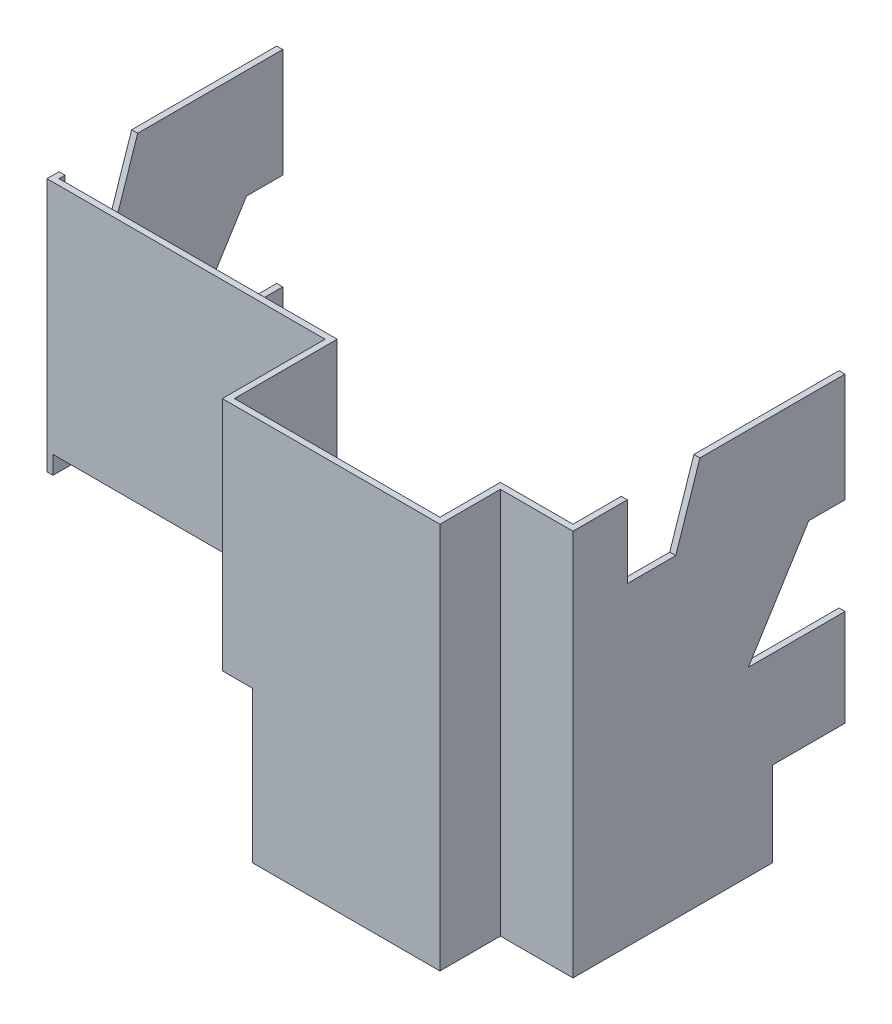
ISO-10303-21;
HEADER;
FILE_DESCRIPTION(('STEP AP214'),'2;1');
FILE_NAME('part.step','',(''),(''),'','','');
FILE_SCHEMA(('AUTOMOTIVE_DESIGN { 1 0 10303 214 1 1 1 1 }'));
ENDSEC;
DATA;
#1=APPLICATION_CONTEXT('core data for automotive mechanical design processes');
#2=APPLICATION_PROTOCOL_DEFINITION('international standard','automotive_design',2000,#1);
#3=PRODUCT_CONTEXT('',#1,'mechanical');
#4=PRODUCT('Part','Part','',(#3));
#5=PRODUCT_RELATED_PRODUCT_CATEGORY('part','',(#4));
#6=PRODUCT_DEFINITION_FORMATION('','',#4);
#7=PRODUCT_DEFINITION_CONTEXT('part definition',#1,'design');
#8=PRODUCT_DEFINITION('design','',#6,#7);
#9=PRODUCT_DEFINITION_SHAPE('','',#8);
#10=(LENGTH_UNIT() NAMED_UNIT(*) SI_UNIT(.MILLI.,.METRE.));
#11=(NAMED_UNIT(*) PLANE_ANGLE_UNIT() SI_UNIT($,.RADIAN.));
#12=(NAMED_UNIT(*) SI_UNIT($,.STERADIAN.) SOLID_ANGLE_UNIT());
#13=UNCERTAINTY_MEASURE_WITH_UNIT(LENGTH_MEASURE(1.E-05),#10,'distance_accuracy_value','');
#14=(GEOMETRIC_REPRESENTATION_CONTEXT(3) GLOBAL_UNCERTAINTY_ASSIGNED_CONTEXT((#13)) GLOBAL_UNIT_ASSIGNED_CONTEXT((#10,
#11,#12)) REPRESENTATION_CONTEXT('',''));
#15=CARTESIAN_POINT('',(0.,0.,0.));
#16=DIRECTION('',(0.,0.,1.));
#17=DIRECTION('',(1.,0.,0.));
#18=AXIS2_PLACEMENT_3D('',#15,#16,#17);
#19=CARTESIAN_POINT('',(596.9,406.4,-241.3));
#20=DIRECTION('',(0.,0.,1.));
#21=DIRECTION('',(1.,0.,0.));
#22=AXIS2_PLACEMENT_3D('',#19,#20,#21);
#23=PLANE('',#22);
#24=DIRECTION('',(0.,-1.,0.));
#25=VECTOR('',#24,1.);
#26=CARTESIAN_POINT('',(596.9,406.4,-241.3));
#27=LINE('',#26,#25);
#28=CARTESIAN_POINT('',(596.9,406.4,-241.3));
#29=VERTEX_POINT('',#28);
#30=CARTESIAN_POINT('',(596.9,292.1,-241.3));
#31=VERTEX_POINT('',#30);
#32=EDGE_CURVE('E314',#29,#31,#27,.T.);
#33=ORIENTED_EDGE('',*,*,#32,.T.);
#34=DIRECTION('',(-1.,0.,0.));
#35=VECTOR('',#34,1.);
#36=CARTESIAN_POINT('',(596.9,292.1,-241.3));
#37=LINE('',#36,#35);
#38=CARTESIAN_POINT('',(590.55,292.1,-241.3));
#39=VERTEX_POINT('',#38);
#40=EDGE_CURVE('E564',#31,#39,#37,.T.);
#41=ORIENTED_EDGE('',*,*,#40,.T.);
#42=DIRECTION('',(0.,-1.,0.));
#43=VECTOR('',#42,1.);
#44=CARTESIAN_POINT('',(590.55,406.4,-241.3));
#45=LINE('',#44,#43);
#46=CARTESIAN_POINT('',(590.55,406.4,-241.3));
#47=VERTEX_POINT('',#46);
#48=EDGE_CURVE('E315',#47,#39,#45,.T.);
#49=ORIENTED_EDGE('',*,*,#48,.F.);
#50=DIRECTION('',(-1.,0.,0.));
#51=VECTOR('',#50,1.);
#52=CARTESIAN_POINT('',(596.9,406.4,-241.3));
#53=LINE('',#52,#51);
#54=EDGE_CURVE('E503',#29,#47,#53,.T.);
#55=ORIENTED_EDGE('',*,*,#54,.F.);
#56=EDGE_LOOP('',(#33,#41,#49,#55));
#57=FACE_BOUND('',#56,.T.);
#58=ADVANCED_FACE('F39',(#57),#23,.F.);
#59=CARTESIAN_POINT('',(0.,406.4,-241.3));
#60=DIRECTION('',(0.,0.,1.));
#61=DIRECTION('',(1.,0.,0.));
#62=AXIS2_PLACEMENT_3D('',#59,#60,#61);
#63=PLANE('',#62);
#64=DIRECTION('',(0.,-1.,0.));
#65=VECTOR('',#64,1.);
#66=CARTESIAN_POINT('',(6.35,406.4,-241.3));
#67=LINE('',#66,#65);
#68=CARTESIAN_POINT('',(6.35,406.4,-241.3));
#69=VERTEX_POINT('',#68);
#70=CARTESIAN_POINT('',(6.34999999999997,292.1,-241.3));
#71=VERTEX_POINT('',#70);
#72=EDGE_CURVE('E393',#69,#71,#67,.T.);
#73=ORIENTED_EDGE('',*,*,#72,.T.);
#74=CARTESIAN_POINT('',(0.,292.1,-241.3));
#75=VERTEX_POINT('',#74);
#76=EDGE_CURVE('E535',#71,#75,#37,.T.);
#77=ORIENTED_EDGE('',*,*,#76,.T.);
#78=DIRECTION('',(0.,-1.,0.));
#79=VECTOR('',#78,1.);
#80=CARTESIAN_POINT('',(0.,406.4,-241.3));
#81=LINE('',#80,#79);
#82=CARTESIAN_POINT('',(0.,406.4,-241.3));
#83=VERTEX_POINT('',#82);
#84=EDGE_CURVE('E390',#83,#75,#81,.T.);
#85=ORIENTED_EDGE('',*,*,#84,.F.);
#86=DIRECTION('',(-1.,0.,0.));
#87=VECTOR('',#86,1.);
#88=CARTESIAN_POINT('',(0.,406.4,-241.3));
#89=LINE('',#88,#87);
#90=EDGE_CURVE('E362',#69,#83,#89,.T.);
#91=ORIENTED_EDGE('',*,*,#90,.F.);
#92=EDGE_LOOP('',(#73,#77,#85,#91));
#93=FACE_BOUND('',#92,.T.);
#94=ADVANCED_FACE('F533',(#93),#63,.F.);
#95=CARTESIAN_POINT('',(0.,406.4,0.));
#96=DIRECTION('',(0.,-1.,0.));
#97=DIRECTION('',(0.,0.,-1.));
#98=AXIS2_PLACEMENT_3D('',#95,#96,#97);
#99=PLANE('',#98);
#100=DIRECTION('',(0.,0.,1.));
#101=VECTOR('',#100,1.);
#102=CARTESIAN_POINT('',(590.55,406.4,-241.3));
#103=LINE('',#102,#101);
#104=CARTESIAN_POINT('',(590.55,406.4,-88.9));
#105=VERTEX_POINT('',#104);
#106=EDGE_CURVE('E506',#47,#105,#103,.T.);
#107=ORIENTED_EDGE('',*,*,#106,.T.);
#108=DIRECTION('',(-1.,0.,0.));
#109=VECTOR('',#108,1.);
#110=CARTESIAN_POINT('',(596.9,406.4,-88.9));
#111=LINE('',#110,#109);
#112=CARTESIAN_POINT('',(596.9,406.4,-88.9));
#113=VERTEX_POINT('',#112);
#114=EDGE_CURVE('E993',#113,#105,#111,.T.);
#115=ORIENTED_EDGE('',*,*,#114,.F.);
#116=DIRECTION('',(0.,0.,-1.));
#117=VECTOR('',#116,1.);
#118=CARTESIAN_POINT('',(596.9,406.4,44.45));
#119=LINE('',#118,#117);
#120=EDGE_CURVE('E500',#113,#29,#119,.T.);
#121=ORIENTED_EDGE('',*,*,#120,.T.);
#122=ORIENTED_EDGE('',*,*,#54,.T.);
#123=EDGE_LOOP('',(#107,#115,#121,#122));
#124=FACE_BOUND('',#123,.T.);
#125=ADVANCED_FACE('F656',(#124),#99,.F.);
#126=DIRECTION('',(0.,0.,1.));
#127=VECTOR('',#126,1.);
#128=CARTESIAN_POINT('',(0.,406.4,0.));
#129=LINE('',#128,#127);
#130=CARTESIAN_POINT('',(0.,406.4,-88.9));
#131=VERTEX_POINT('',#130);
#132=EDGE_CURVE('E361',#83,#131,#129,.T.);
#133=ORIENTED_EDGE('',*,*,#132,.T.);
#134=DIRECTION('',(1.,0.,0.));
#135=VECTOR('',#134,1.);
#136=CARTESIAN_POINT('',(0.,406.4,-88.9));
#137=LINE('',#136,#135);
#138=CARTESIAN_POINT('',(6.34999999999997,406.4,-88.9));
#139=VERTEX_POINT('',#138);
#140=EDGE_CURVE('E11',#131,#139,#137,.T.);
#141=ORIENTED_EDGE('',*,*,#140,.T.);
#142=DIRECTION('',(0.,0.,-1.));
#143=VECTOR('',#142,1.);
#144=CARTESIAN_POINT('',(6.35,406.4,-241.3));
#145=LINE('',#144,#143);
#146=EDGE_CURVE('E518',#139,#69,#145,.T.);
#147=ORIENTED_EDGE('',*,*,#146,.T.);
#148=ORIENTED_EDGE('',*,*,#90,.T.);
#149=EDGE_LOOP('',(#133,#141,#147,#148));
#150=FACE_BOUND('',#149,.T.);
#151=ADVANCED_FACE('F522',(#150),#99,.F.);
#152=CARTESIAN_POINT('',(0.,406.4,0.));
#153=DIRECTION('',(0.,0.,-1.));
#154=DIRECTION('',(-1.,0.,0.));
#155=AXIS2_PLACEMENT_3D('',#152,#153,#154);
#156=PLANE('',#155);
#157=DIRECTION('',(0.,-1.,0.));
#158=VECTOR('',#157,1.);
#159=CARTESIAN_POINT('',(0.,406.4,0.));
#160=LINE('',#159,#158);
#161=CARTESIAN_POINT('',(0.,406.4,0.));
#162=VERTEX_POINT('',#161);
#163=CARTESIAN_POINT('',(0.,139.7,0.));
#164=VERTEX_POINT('',#163);
#165=EDGE_CURVE('E359',#162,#164,#160,.T.);
#166=ORIENTED_EDGE('',*,*,#165,.T.);
#167=DIRECTION('',(-1.,0.,0.));
#168=VECTOR('',#167,1.);
#169=CARTESIAN_POINT('',(596.901,139.7,0.));
#170=LINE('',#169,#168);
#171=CARTESIAN_POINT('',(6.35000000000002,139.7,0.));
#172=VERTEX_POINT('',#171);
#173=EDGE_CURVE('E457',#172,#164,#170,.T.);
#174=ORIENTED_EDGE('',*,*,#173,.F.);
#175=DIRECTION('',(0.,1.,0.));
#176=VECTOR('',#175,1.);
#177=CARTESIAN_POINT('',(6.35,406.4,0.));
#178=LINE('',#177,#176);
#179=CARTESIAN_POINT('',(6.35000000000002,158.75,-1.11022302462516E-13));
#180=VERTEX_POINT('',#179);
#181=EDGE_CURVE('E478',#172,#180,#178,.T.);
#182=ORIENTED_EDGE('',*,*,#181,.T.);
#183=DIRECTION('',(1.,0.,0.));
#184=VECTOR('',#183,1.);
#185=CARTESIAN_POINT('',(0.,158.75,0.));
#186=LINE('',#185,#184);
#187=CARTESIAN_POINT('',(292.1,158.75,0.));
#188=VERTEX_POINT('',#187);
#189=EDGE_CURVE('E371',#180,#188,#186,.T.);
#190=ORIENTED_EDGE('',*,*,#189,.T.);
#191=DIRECTION('',(0.,-1.,0.));
#192=VECTOR('',#191,1.);
#193=CARTESIAN_POINT('',(292.1,406.4,0.));
#194=LINE('',#193,#192);
#195=CARTESIAN_POINT('',(292.1,406.4,0.));
#196=VERTEX_POINT('',#195);
#197=EDGE_CURVE('E334',#196,#188,#194,.T.);
#198=ORIENTED_EDGE('',*,*,#197,.F.);
#199=DIRECTION('',(1.,0.,0.));
#200=VECTOR('',#199,1.);
#201=CARTESIAN_POINT('',(0.,406.4,0.));
#202=LINE('',#201,#200);
#203=EDGE_CURVE('E387',#162,#196,#202,.T.);
#204=ORIENTED_EDGE('',*,*,#203,.F.);
#205=EDGE_LOOP('',(#166,#174,#182,#190,#198,#204));
#206=FACE_BOUND('',#205,.T.);
#207=ADVANCED_FACE('F41',(#206),#156,.F.);
#208=CARTESIAN_POINT('',(292.1,406.4,0.));
#209=DIRECTION('',(1.,0.,0.));
#210=DIRECTION('',(0.,0.,-1.));
#211=AXIS2_PLACEMENT_3D('',#208,#209,#210);
#212=PLANE('',#211);
#213=ORIENTED_EDGE('',*,*,#197,.T.);
#214=DIRECTION('',(0.,0.,1.));
#215=VECTOR('',#214,1.);
#216=CARTESIAN_POINT('',(292.1,158.75,0.));
#217=LINE('',#216,#215);
#218=CARTESIAN_POINT('',(292.1,158.75,107.95));
#219=VERTEX_POINT('',#218);
#220=EDGE_CURVE('E486',#188,#219,#217,.T.);
#221=ORIENTED_EDGE('',*,*,#220,.T.);
#222=DIRECTION('',(0.,-1.,0.));
#223=VECTOR('',#222,1.);
#224=CARTESIAN_POINT('',(292.1,406.4,107.95));
#225=LINE('',#224,#223);
#226=CARTESIAN_POINT('',(292.1,406.4,107.95));
#227=VERTEX_POINT('',#226);
#228=EDGE_CURVE('E331',#227,#219,#225,.T.);
#229=ORIENTED_EDGE('',*,*,#228,.F.);
#230=DIRECTION('',(0.,0.,1.));
#231=VECTOR('',#230,1.);
#232=CARTESIAN_POINT('',(292.1,406.4,0.));
#233=LINE('',#232,#231);
#234=EDGE_CURVE('E492',#196,#227,#233,.T.);
#235=ORIENTED_EDGE('',*,*,#234,.F.);
#236=EDGE_LOOP('',(#213,#221,#229,#235));
#237=FACE_BOUND('',#236,.T.);
#238=ADVANCED_FACE('F675',(#237),#212,.F.);
#239=CARTESIAN_POINT('',(292.1,406.4,107.95));
#240=DIRECTION('',(0.,0.,-1.));
#241=DIRECTION('',(-1.,0.,0.));
#242=AXIS2_PLACEMENT_3D('',#239,#240,#241);
#243=PLANE('',#242);
#244=ORIENTED_EDGE('',*,*,#228,.T.);
#245=DIRECTION('',(-1.,0.,0.));
#246=VECTOR('',#245,1.);
#247=CARTESIAN_POINT('',(323.85,158.75,107.95));
#248=LINE('',#247,#246);
#249=CARTESIAN_POINT('',(323.85,158.75,107.95));
#250=VERTEX_POINT('',#249);
#251=EDGE_CURVE('E470',#250,#219,#248,.T.);
#252=ORIENTED_EDGE('',*,*,#251,.F.);
#253=DIRECTION('',(0.,1.,0.));
#254=VECTOR('',#253,1.);
#255=CARTESIAN_POINT('',(323.85,0.,107.95));
#256=LINE('',#255,#254);
#257=CARTESIAN_POINT('',(323.85,0.,107.95));
#258=VERTEX_POINT('',#257);
#259=EDGE_CURVE('E463',#258,#250,#256,.T.);
#260=ORIENTED_EDGE('',*,*,#259,.F.);
#261=DIRECTION('',(1.,0.,0.));
#262=VECTOR('',#261,1.);
#263=CARTESIAN_POINT('',(292.1,0.,107.95));
#264=LINE('',#263,#262);
#265=CARTESIAN_POINT('',(520.7,0.,107.95));
#266=VERTEX_POINT('',#265);
#267=EDGE_CURVE('E368',#258,#266,#264,.T.);
#268=ORIENTED_EDGE('',*,*,#267,.T.);
#269=DIRECTION('',(0.,-1.,0.));
#270=VECTOR('',#269,1.);
#271=CARTESIAN_POINT('',(520.7,406.4,107.95));
#272=LINE('',#271,#270);
#273=CARTESIAN_POINT('',(520.7,406.4,107.95));
#274=VERTEX_POINT('',#273);
#275=EDGE_CURVE('E328',#274,#266,#272,.T.);
#276=ORIENTED_EDGE('',*,*,#275,.F.);
#277=DIRECTION('',(1.,0.,0.));
#278=VECTOR('',#277,1.);
#279=CARTESIAN_POINT('',(292.1,406.4,107.95));
#280=LINE('',#279,#278);
#281=EDGE_CURVE('E494',#227,#274,#280,.T.);
#282=ORIENTED_EDGE('',*,*,#281,.F.);
#283=EDGE_LOOP('',(#244,#252,#260,#268,#276,#282));
#284=FACE_BOUND('',#283,.T.);
#285=ADVANCED_FACE('F614',(#284),#243,.F.);
#286=CARTESIAN_POINT('',(520.7,406.4,107.95));
#287=DIRECTION('',(-1.,0.,0.));
#288=DIRECTION('',(0.,0.,1.));
#289=AXIS2_PLACEMENT_3D('',#286,#287,#288);
#290=PLANE('',#289);
#291=DIRECTION('',(0.,0.,-1.));
#292=VECTOR('',#291,1.);
#293=CARTESIAN_POINT('',(520.7,0.,107.95));
#294=LINE('',#293,#292);
#295=CARTESIAN_POINT('',(520.7,0.,44.45));
#296=VERTEX_POINT('',#295);
#297=EDGE_CURVE('E370',#266,#296,#294,.T.);
#298=ORIENTED_EDGE('',*,*,#297,.T.);
#299=DIRECTION('',(0.,-1.,0.));
#300=VECTOR('',#299,1.);
#301=CARTESIAN_POINT('',(520.7,406.4,44.45));
#302=LINE('',#301,#300);
#303=CARTESIAN_POINT('',(520.7,406.4,44.45));
#304=VERTEX_POINT('',#303);
#305=EDGE_CURVE('E325',#304,#296,#302,.T.);
#306=ORIENTED_EDGE('',*,*,#305,.F.);
#307=DIRECTION('',(0.,0.,-1.));
#308=VECTOR('',#307,1.);
#309=CARTESIAN_POINT('',(520.7,406.4,107.95));
#310=LINE('',#309,#308);
#311=EDGE_CURVE('E496',#274,#304,#310,.T.);
#312=ORIENTED_EDGE('',*,*,#311,.F.);
#313=ORIENTED_EDGE('',*,*,#275,.T.);
#314=EDGE_LOOP('',(#298,#306,#312,#313));
#315=FACE_BOUND('',#314,.T.);
#316=ADVANCED_FACE('F609',(#315),#290,.F.);
#317=CARTESIAN_POINT('',(520.7,406.4,44.45));
#318=DIRECTION('',(0.,0.,-1.));
#319=DIRECTION('',(-1.,0.,0.));
#320=AXIS2_PLACEMENT_3D('',#317,#318,#319);
#321=PLANE('',#320);
#322=DIRECTION('',(1.,0.,0.));
#323=VECTOR('',#322,1.);
#324=CARTESIAN_POINT('',(520.7,0.,44.45));
#325=LINE('',#324,#323);
#326=CARTESIAN_POINT('',(596.9,0.,44.45));
#327=VERTEX_POINT('',#326);
#328=EDGE_CURVE('E373',#296,#327,#325,.T.);
#329=ORIENTED_EDGE('',*,*,#328,.T.);
#330=DIRECTION('',(0.,-1.,0.));
#331=VECTOR('',#330,1.);
#332=CARTESIAN_POINT('',(596.9,406.4,44.45));
#333=LINE('',#332,#331);
#334=CARTESIAN_POINT('',(596.9,406.4,44.45));
#335=VERTEX_POINT('',#334);
#336=EDGE_CURVE('E318',#335,#327,#333,.T.);
#337=ORIENTED_EDGE('',*,*,#336,.F.);
#338=DIRECTION('',(1.,0.,0.));
#339=VECTOR('',#338,1.);
#340=CARTESIAN_POINT('',(520.7,406.4,44.45));
#341=LINE('',#340,#339);
#342=EDGE_CURVE('E498',#304,#335,#341,.T.);
#343=ORIENTED_EDGE('',*,*,#342,.F.);
#344=ORIENTED_EDGE('',*,*,#305,.T.);
#345=EDGE_LOOP('',(#329,#337,#343,#344));
#346=FACE_BOUND('',#345,.T.);
#347=ADVANCED_FACE('F603',(#346),#321,.F.);
#348=CARTESIAN_POINT('',(596.9,406.4,44.45));
#349=DIRECTION('',(-1.,0.,0.));
#350=DIRECTION('',(0.,0.,1.));
#351=AXIS2_PLACEMENT_3D('',#348,#349,#350);
#352=PLANE('',#351);
#353=DIRECTION('',(0.,0.847998304005088,-0.52999894000318));
#354=VECTOR('',#353,1.);
#355=CARTESIAN_POINT('',(596.9,292.1,-203.2));
#356=LINE('',#355,#354);
#357=CARTESIAN_POINT('',(596.9,190.5,-139.7));
#358=VERTEX_POINT('',#357);
#359=CARTESIAN_POINT('',(596.9,292.1,-203.2));
#360=VERTEX_POINT('',#359);
#361=EDGE_CURVE('E297',#358,#360,#356,.T.);
#362=ORIENTED_EDGE('',*,*,#361,.T.);
#363=DIRECTION('',(0.,0.,-1.));
#364=VECTOR('',#363,1.);
#365=CARTESIAN_POINT('',(596.9,292.1,-241.3));
#366=LINE('',#365,#364);
#367=EDGE_CURVE('E974',#360,#31,#366,.T.);
#368=ORIENTED_EDGE('',*,*,#367,.T.);
#369=ORIENTED_EDGE('',*,*,#32,.F.);
#370=ORIENTED_EDGE('',*,*,#120,.F.);
#371=DIRECTION('',(0.,-0.948683298050514,0.316227766016838));
#372=VECTOR('',#371,1.);
#373=CARTESIAN_POINT('',(596.9,406.4,-88.9));
#374=LINE('',#373,#372);
#375=CARTESIAN_POINT('',(596.9,330.2,-63.5));
#376=VERTEX_POINT('',#375);
#377=EDGE_CURVE('E558',#113,#376,#374,.T.);
#378=ORIENTED_EDGE('',*,*,#377,.T.);
#379=DIRECTION('',(0.,0.,1.));
#380=VECTOR('',#379,1.);
#381=CARTESIAN_POINT('',(596.9,330.2,-63.5));
#382=LINE('',#381,#380);
#383=CARTESIAN_POINT('',(596.9,330.2,-12.7));
#384=VERTEX_POINT('',#383);
#385=EDGE_CURVE('E554',#376,#384,#382,.T.);
#386=ORIENTED_EDGE('',*,*,#385,.T.);
#387=DIRECTION('',(0.,1.,0.));
#388=VECTOR('',#387,1.);
#389=CARTESIAN_POINT('',(596.9,406.4,-12.7));
#390=LINE('',#389,#388);
#391=CARTESIAN_POINT('',(596.9,406.4,-12.7));
#392=VERTEX_POINT('',#391);
#393=EDGE_CURVE('E551',#384,#392,#390,.T.);
#394=ORIENTED_EDGE('',*,*,#393,.T.);
#395=EDGE_CURVE('E501',#335,#392,#119,.T.);
#396=ORIENTED_EDGE('',*,*,#395,.F.);
#397=ORIENTED_EDGE('',*,*,#336,.T.);
#398=DIRECTION('',(0.,0.,-1.));
#399=VECTOR('',#398,1.);
#400=CARTESIAN_POINT('',(596.9,0.,44.45));
#401=LINE('',#400,#399);
#402=CARTESIAN_POINT('',(596.9,0.,-165.1));
#403=VERTEX_POINT('',#402);
#404=EDGE_CURVE('E375',#327,#403,#401,.T.);
#405=ORIENTED_EDGE('',*,*,#404,.T.);
#406=DIRECTION('',(0.,-1.,0.));
#407=VECTOR('',#406,1.);
#408=CARTESIAN_POINT('',(596.9,0.,-165.1));
#409=LINE('',#408,#407);
#410=CARTESIAN_POINT('',(596.9,88.9,-165.1));
#411=VERTEX_POINT('',#410);
#412=EDGE_CURVE('E432',#411,#403,#409,.T.);
#413=ORIENTED_EDGE('',*,*,#412,.F.);
#414=DIRECTION('',(0.,0.,1.));
#415=VECTOR('',#414,1.);
#416=CARTESIAN_POINT('',(596.9,88.9,-241.3));
#417=LINE('',#416,#415);
#418=CARTESIAN_POINT('',(596.9,88.9,-241.3));
#419=VERTEX_POINT('',#418);
#420=EDGE_CURVE('E313',#419,#411,#417,.T.);
#421=ORIENTED_EDGE('',*,*,#420,.F.);
#422=CARTESIAN_POINT('',(596.9,190.5,-241.3));
#423=VERTEX_POINT('',#422);
#424=EDGE_CURVE('E304',#423,#419,#27,.T.);
#425=ORIENTED_EDGE('',*,*,#424,.F.);
#426=DIRECTION('',(0.,0.,1.));
#427=VECTOR('',#426,1.);
#428=CARTESIAN_POINT('',(596.9,190.5,-241.3));
#429=LINE('',#428,#427);
#430=EDGE_CURVE('E289',#423,#358,#429,.T.);
#431=ORIENTED_EDGE('',*,*,#430,.T.);
#432=EDGE_LOOP('',(#362,#368,#369,#370,#378,#386,#394,#396,#397,#405,#413,#421,#425,#431));
#433=FACE_BOUND('',#432,.T.);
#434=ADVANCED_FACE('F310',(#433),#352,.F.);
#435=CARTESIAN_POINT('',(590.55,190.5,-241.3));
#436=VERTEX_POINT('',#435);
#437=CARTESIAN_POINT('',(590.55,88.9,-241.3));
#438=VERTEX_POINT('',#437);
#439=EDGE_CURVE('E306',#436,#438,#45,.T.);
#440=ORIENTED_EDGE('',*,*,#439,.F.);
#441=DIRECTION('',(-1.,0.,0.));
#442=VECTOR('',#441,1.);
#443=CARTESIAN_POINT('',(596.9,190.5,-241.3));
#444=LINE('',#443,#442);
#445=EDGE_CURVE('E54',#423,#436,#444,.T.);
#446=ORIENTED_EDGE('',*,*,#445,.F.);
#447=ORIENTED_EDGE('',*,*,#424,.T.);
#448=DIRECTION('',(1.,0.,0.));
#449=VECTOR('',#448,1.);
#450=CARTESIAN_POINT('',(-0.00100000000013978,88.9,-241.3));
#451=LINE('',#450,#449);
#452=EDGE_CURVE('E426',#438,#419,#451,.T.);
#453=ORIENTED_EDGE('',*,*,#452,.F.);
#454=EDGE_LOOP('',(#440,#446,#447,#453));
#455=FACE_BOUND('',#454,.T.);
#456=ADVANCED_FACE('F302',(#455),#23,.F.);
#457=CARTESIAN_POINT('',(590.55,406.4,-241.3));
#458=DIRECTION('',(1.,0.,0.));
#459=DIRECTION('',(0.,0.,-1.));
#460=AXIS2_PLACEMENT_3D('',#457,#458,#459);
#461=PLANE('',#460);
#462=ORIENTED_EDGE('',*,*,#48,.T.);
#463=DIRECTION('',(0.,0.,1.));
#464=VECTOR('',#463,1.);
#465=CARTESIAN_POINT('',(590.55,292.1,-241.3));
#466=LINE('',#465,#464);
#467=CARTESIAN_POINT('',(590.55,292.1,-203.2));
#468=VERTEX_POINT('',#467);
#469=EDGE_CURVE('E587',#39,#468,#466,.T.);
#470=ORIENTED_EDGE('',*,*,#469,.T.);
#471=DIRECTION('',(0.,-0.847998304005088,0.52999894000318));
#472=VECTOR('',#471,1.);
#473=CARTESIAN_POINT('',(590.55,391.416853932584,-265.273033707865));
#474=LINE('',#473,#472);
#475=CARTESIAN_POINT('',(590.55,190.5,-139.7));
#476=VERTEX_POINT('',#475);
#477=EDGE_CURVE('E584',#468,#476,#474,.T.);
#478=ORIENTED_EDGE('',*,*,#477,.T.);
#479=DIRECTION('',(0.,0.,-1.));
#480=VECTOR('',#479,1.);
#481=CARTESIAN_POINT('',(590.55,190.5,-241.3));
#482=LINE('',#481,#480);
#483=EDGE_CURVE('E423',#476,#436,#482,.T.);
#484=ORIENTED_EDGE('',*,*,#483,.T.);
#485=ORIENTED_EDGE('',*,*,#439,.T.);
#486=DIRECTION('',(0.,0.,-1.));
#487=VECTOR('',#486,1.);
#488=CARTESIAN_POINT('',(590.55,88.9,-241.3));
#489=LINE('',#488,#487);
#490=CARTESIAN_POINT('',(590.55,88.9,-165.1));
#491=VERTEX_POINT('',#490);
#492=EDGE_CURVE('E421',#491,#438,#489,.T.);
#493=ORIENTED_EDGE('',*,*,#492,.F.);
#494=DIRECTION('',(0.,1.,0.));
#495=VECTOR('',#494,1.);
#496=CARTESIAN_POINT('',(590.55,0.,-165.1));
#497=LINE('',#496,#495);
#498=CARTESIAN_POINT('',(590.55,0.,-165.1));
#499=VERTEX_POINT('',#498);
#500=EDGE_CURVE('E590',#499,#491,#497,.T.);
#501=ORIENTED_EDGE('',*,*,#500,.F.);
#502=DIRECTION('',(0.,0.,1.));
#503=VECTOR('',#502,1.);
#504=CARTESIAN_POINT('',(590.55,0.,-241.3));
#505=LINE('',#504,#503);
#506=CARTESIAN_POINT('',(590.55,0.,38.1));
#507=VERTEX_POINT('',#506);
#508=EDGE_CURVE('E378',#499,#507,#505,.T.);
#509=ORIENTED_EDGE('',*,*,#508,.T.);
#510=DIRECTION('',(0.,-1.,0.));
#511=VECTOR('',#510,1.);
#512=CARTESIAN_POINT('',(590.55,406.4,38.1));
#513=LINE('',#512,#511);
#514=CARTESIAN_POINT('',(590.55,406.4,38.1));
#515=VERTEX_POINT('',#514);
#516=EDGE_CURVE('E410',#515,#507,#513,.T.);
#517=ORIENTED_EDGE('',*,*,#516,.F.);
#518=CARTESIAN_POINT('',(590.55,406.4,-12.7));
#519=VERTEX_POINT('',#518);
#520=EDGE_CURVE('E505',#519,#515,#103,.T.);
#521=ORIENTED_EDGE('',*,*,#520,.F.);
#522=DIRECTION('',(0.,-1.,0.));
#523=VECTOR('',#522,1.);
#524=CARTESIAN_POINT('',(590.55,406.4,-12.7));
#525=LINE('',#524,#523);
#526=CARTESIAN_POINT('',(590.55,330.2,-12.7));
#527=VERTEX_POINT('',#526);
#528=EDGE_CURVE('E563',#519,#527,#525,.T.);
#529=ORIENTED_EDGE('',*,*,#528,.T.);
#530=DIRECTION('',(0.,0.,-1.));
#531=VECTOR('',#530,1.);
#532=CARTESIAN_POINT('',(590.55,330.2,-241.3));
#533=LINE('',#532,#531);
#534=CARTESIAN_POINT('',(590.55,330.2,-63.5));
#535=VERTEX_POINT('',#534);
#536=EDGE_CURVE('E575',#527,#535,#533,.T.);
#537=ORIENTED_EDGE('',*,*,#536,.T.);
#538=DIRECTION('',(0.,0.948683298050514,-0.316227766016838));
#539=VECTOR('',#538,1.);
#540=CARTESIAN_POINT('',(590.55,452.12,-104.14));
#541=LINE('',#540,#539);
#542=EDGE_CURVE('E569',#535,#105,#541,.T.);
#543=ORIENTED_EDGE('',*,*,#542,.T.);
#544=ORIENTED_EDGE('',*,*,#106,.F.);
#545=EDGE_LOOP('',(#462,#470,#478,#484,#485,#493,#501,#509,#517,#521,#529,#537,#543,#544));
#546=FACE_BOUND('',#545,.T.);
#547=ADVANCED_FACE('F419',(#546),#461,.F.);
#548=CARTESIAN_POINT('',(590.55,406.4,38.1));
#549=DIRECTION('',(0.,0.,1.));
#550=DIRECTION('',(1.,0.,0.));
#551=AXIS2_PLACEMENT_3D('',#548,#549,#550);
#552=PLANE('',#551);
#553=DIRECTION('',(-1.,0.,0.));
#554=VECTOR('',#553,1.);
#555=CARTESIAN_POINT('',(590.55,0.,38.1));
#556=LINE('',#555,#554);
#557=CARTESIAN_POINT('',(514.35,0.,38.1));
#558=VERTEX_POINT('',#557);
#559=EDGE_CURVE('E380',#507,#558,#556,.T.);
#560=ORIENTED_EDGE('',*,*,#559,.T.);
#561=DIRECTION('',(0.,-1.,0.));
#562=VECTOR('',#561,1.);
#563=CARTESIAN_POINT('',(514.35,406.4,38.1));
#564=LINE('',#563,#562);
#565=CARTESIAN_POINT('',(514.35,406.4,38.1));
#566=VERTEX_POINT('',#565);
#567=EDGE_CURVE('E408',#566,#558,#564,.T.);
#568=ORIENTED_EDGE('',*,*,#567,.F.);
#569=DIRECTION('',(-1.,0.,0.));
#570=VECTOR('',#569,1.);
#571=CARTESIAN_POINT('',(590.55,406.4,38.1));
#572=LINE('',#571,#570);
#573=EDGE_CURVE('E509',#515,#566,#572,.T.);
#574=ORIENTED_EDGE('',*,*,#573,.F.);
#575=ORIENTED_EDGE('',*,*,#516,.T.);
#576=EDGE_LOOP('',(#560,#568,#574,#575));
#577=FACE_BOUND('',#576,.T.);
#578=ADVANCED_FACE('F631',(#577),#552,.F.);
#579=CARTESIAN_POINT('',(514.35,406.4,38.1));
#580=DIRECTION('',(1.,0.,0.));
#581=DIRECTION('',(0.,0.,-1.));
#582=AXIS2_PLACEMENT_3D('',#579,#580,#581);
#583=PLANE('',#582);
#584=DIRECTION('',(0.,0.,1.));
#585=VECTOR('',#584,1.);
#586=CARTESIAN_POINT('',(514.35,0.,38.1));
#587=LINE('',#586,#585);
#588=CARTESIAN_POINT('',(514.35,0.,101.6));
#589=VERTEX_POINT('',#588);
#590=EDGE_CURVE('E382',#558,#589,#587,.T.);
#591=ORIENTED_EDGE('',*,*,#590,.T.);
#592=DIRECTION('',(0.,-1.,0.));
#593=VECTOR('',#592,1.);
#594=CARTESIAN_POINT('',(514.35,406.4,101.6));
#595=LINE('',#594,#593);
#596=CARTESIAN_POINT('',(514.35,406.4,101.6));
#597=VERTEX_POINT('',#596);
#598=EDGE_CURVE('E405',#597,#589,#595,.T.);
#599=ORIENTED_EDGE('',*,*,#598,.F.);
#600=DIRECTION('',(0.,0.,1.));
#601=VECTOR('',#600,1.);
#602=CARTESIAN_POINT('',(514.35,406.4,38.1));
#603=LINE('',#602,#601);
#604=EDGE_CURVE('E511',#566,#597,#603,.T.);
#605=ORIENTED_EDGE('',*,*,#604,.F.);
#606=ORIENTED_EDGE('',*,*,#567,.T.);
#607=EDGE_LOOP('',(#591,#599,#605,#606));
#608=FACE_BOUND('',#607,.T.);
#609=ADVANCED_FACE('F629',(#608),#583,.F.);
#610=CARTESIAN_POINT('',(514.35,406.4,101.6));
#611=DIRECTION('',(0.,0.,1.));
#612=DIRECTION('',(1.,0.,0.));
#613=AXIS2_PLACEMENT_3D('',#610,#611,#612);
#614=PLANE('',#613);
#615=DIRECTION('',(0.,1.,0.));
#616=VECTOR('',#615,1.);
#617=CARTESIAN_POINT('',(323.85,406.4,101.6));
#618=LINE('',#617,#616);
#619=CARTESIAN_POINT('',(323.85,0.,101.6));
#620=VERTEX_POINT('',#619);
#621=CARTESIAN_POINT('',(323.85,158.75,101.6));
#622=VERTEX_POINT('',#621);
#623=EDGE_CURVE('E466',#620,#622,#618,.T.);
#624=ORIENTED_EDGE('',*,*,#623,.T.);
#625=DIRECTION('',(-1.,0.,0.));
#626=VECTOR('',#625,1.);
#627=CARTESIAN_POINT('',(514.35,158.75,101.6));
#628=LINE('',#627,#626);
#629=CARTESIAN_POINT('',(298.45,158.75,101.6));
#630=VERTEX_POINT('',#629);
#631=EDGE_CURVE('E483',#622,#630,#628,.T.);
#632=ORIENTED_EDGE('',*,*,#631,.T.);
#633=DIRECTION('',(0.,-1.,0.));
#634=VECTOR('',#633,1.);
#635=CARTESIAN_POINT('',(298.45,406.4,101.6));
#636=LINE('',#635,#634);
#637=CARTESIAN_POINT('',(298.45,406.4,101.6));
#638=VERTEX_POINT('',#637);
#639=EDGE_CURVE('E402',#638,#630,#636,.T.);
#640=ORIENTED_EDGE('',*,*,#639,.F.);
#641=DIRECTION('',(-1.,0.,0.));
#642=VECTOR('',#641,1.);
#643=CARTESIAN_POINT('',(514.35,406.4,101.6));
#644=LINE('',#643,#642);
#645=EDGE_CURVE('E513',#597,#638,#644,.T.);
#646=ORIENTED_EDGE('',*,*,#645,.F.);
#647=ORIENTED_EDGE('',*,*,#598,.T.);
#648=DIRECTION('',(-1.,0.,0.));
#649=VECTOR('',#648,1.);
#650=CARTESIAN_POINT('',(514.35,0.,101.6));
#651=LINE('',#650,#649);
#652=EDGE_CURVE('E384',#589,#620,#651,.T.);
#653=ORIENTED_EDGE('',*,*,#652,.T.);
#654=EDGE_LOOP('',(#624,#632,#640,#646,#647,#653));
#655=FACE_BOUND('',#654,.T.);
#656=ADVANCED_FACE('F623',(#655),#614,.F.);
#657=CARTESIAN_POINT('',(298.45,406.4,101.6));
#658=DIRECTION('',(-1.,0.,0.));
#659=DIRECTION('',(0.,0.,1.));
#660=AXIS2_PLACEMENT_3D('',#657,#658,#659);
#661=PLANE('',#660);
#662=ORIENTED_EDGE('',*,*,#639,.T.);
#663=DIRECTION('',(0.,0.,-1.));
#664=VECTOR('',#663,1.);
#665=CARTESIAN_POINT('',(298.45,158.75,101.6));
#666=LINE('',#665,#664);
#667=CARTESIAN_POINT('',(298.45,158.75,-6.35000000000002));
#668=VERTEX_POINT('',#667);
#669=EDGE_CURVE('E480',#630,#668,#666,.T.);
#670=ORIENTED_EDGE('',*,*,#669,.T.);
#671=DIRECTION('',(0.,-1.,0.));
#672=VECTOR('',#671,1.);
#673=CARTESIAN_POINT('',(298.45,406.4,-6.35));
#674=LINE('',#673,#672);
#675=CARTESIAN_POINT('',(298.45,406.4,-6.35));
#676=VERTEX_POINT('',#675);
#677=EDGE_CURVE('E399',#676,#668,#674,.T.);
#678=ORIENTED_EDGE('',*,*,#677,.F.);
#679=DIRECTION('',(0.,0.,-1.));
#680=VECTOR('',#679,1.);
#681=CARTESIAN_POINT('',(298.45,406.4,101.6));
#682=LINE('',#681,#680);
#683=EDGE_CURVE('E515',#638,#676,#682,.T.);
#684=ORIENTED_EDGE('',*,*,#683,.F.);
#685=EDGE_LOOP('',(#662,#670,#678,#684));
#686=FACE_BOUND('',#685,.T.);
#687=ADVANCED_FACE('F698',(#686),#661,.F.);
#688=CARTESIAN_POINT('',(6.35000000000004,406.4,-6.35000000000002));
#689=DIRECTION('',(0.,0.,1.));
#690=DIRECTION('',(1.,0.,0.));
#691=AXIS2_PLACEMENT_3D('',#688,#689,#690);
#692=PLANE('',#691);
#693=ORIENTED_EDGE('',*,*,#677,.T.);
#694=DIRECTION('',(1.,0.,0.));
#695=VECTOR('',#694,1.);
#696=CARTESIAN_POINT('',(323.85,158.75,-6.35000000000002));
#697=LINE('',#696,#695);
#698=CARTESIAN_POINT('',(6.35000000000002,158.75,-6.35000000000005));
#699=VERTEX_POINT('',#698);
#700=EDGE_CURVE('E464',#699,#668,#697,.T.);
#701=ORIENTED_EDGE('',*,*,#700,.F.);
#702=DIRECTION('',(0.,-1.,0.));
#703=VECTOR('',#702,1.);
#704=CARTESIAN_POINT('',(6.35000000000004,406.4,-6.35000000000002));
#705=LINE('',#704,#703);
#706=CARTESIAN_POINT('',(6.35000000000004,406.4,-6.35000000000002));
#707=VERTEX_POINT('',#706);
#708=EDGE_CURVE('E396',#707,#699,#705,.T.);
#709=ORIENTED_EDGE('',*,*,#708,.F.);
#710=DIRECTION('',(-1.,0.,0.));
#711=VECTOR('',#710,1.);
#712=CARTESIAN_POINT('',(6.35000000000004,406.4,-6.35000000000002));
#713=LINE('',#712,#711);
#714=EDGE_CURVE('E517',#676,#707,#713,.T.);
#715=ORIENTED_EDGE('',*,*,#714,.F.);
#716=EDGE_LOOP('',(#693,#701,#709,#715));
#717=FACE_BOUND('',#716,.T.);
#718=ADVANCED_FACE('F695',(#717),#692,.F.);
#719=CARTESIAN_POINT('',(6.35,406.4,-241.3));
#720=DIRECTION('',(-1.,0.,0.));
#721=DIRECTION('',(0.,0.,1.));
#722=AXIS2_PLACEMENT_3D('',#719,#720,#721);
#723=PLANE('',#722);
#724=DIRECTION('',(0.,0.847998304005088,-0.52999894000318));
#725=VECTOR('',#724,1.);
#726=CARTESIAN_POINT('',(6.35,391.416853932584,-265.273033707865));
#727=LINE('',#726,#725);
#728=CARTESIAN_POINT('',(6.34999999999997,190.5,-139.7));
#729=VERTEX_POINT('',#728);
#730=CARTESIAN_POINT('',(6.34999999999997,292.1,-203.2));
#731=VERTEX_POINT('',#730);
#732=EDGE_CURVE('E582',#729,#731,#727,.T.);
#733=ORIENTED_EDGE('',*,*,#732,.T.);
#734=DIRECTION('',(0.,0.,-1.));
#735=VECTOR('',#734,1.);
#736=CARTESIAN_POINT('',(6.35,292.1,-241.3));
#737=LINE('',#736,#735);
#738=EDGE_CURVE('E530',#731,#71,#737,.T.);
#739=ORIENTED_EDGE('',*,*,#738,.T.);
#740=ORIENTED_EDGE('',*,*,#72,.F.);
#741=ORIENTED_EDGE('',*,*,#146,.F.);
#742=DIRECTION('',(0.,-0.948683298050514,0.316227766016838));
#743=VECTOR('',#742,1.);
#744=CARTESIAN_POINT('',(6.35000000000002,452.12,-104.14));
#745=LINE('',#744,#743);
#746=CARTESIAN_POINT('',(6.35000000000008,330.2,-63.5));
#747=VERTEX_POINT('',#746);
#748=EDGE_CURVE('E567',#139,#747,#745,.T.);
#749=ORIENTED_EDGE('',*,*,#748,.T.);
#750=DIRECTION('',(0.,0.,1.));
#751=VECTOR('',#750,1.);
#752=CARTESIAN_POINT('',(6.35,330.2,-241.3));
#753=LINE('',#752,#751);
#754=CARTESIAN_POINT('',(6.35000000000008,330.2,-12.7));
#755=VERTEX_POINT('',#754);
#756=EDGE_CURVE('E572',#747,#755,#753,.T.);
#757=ORIENTED_EDGE('',*,*,#756,.T.);
#758=DIRECTION('',(0.,1.,0.));
#759=VECTOR('',#758,1.);
#760=CARTESIAN_POINT('',(6.35000000000004,406.4,-12.7));
#761=LINE('',#760,#759);
#762=CARTESIAN_POINT('',(6.34999999999997,406.4,-12.7));
#763=VERTEX_POINT('',#762);
#764=EDGE_CURVE('E561',#755,#763,#761,.T.);
#765=ORIENTED_EDGE('',*,*,#764,.T.);
#766=EDGE_CURVE('E348',#707,#763,#145,.T.);
#767=ORIENTED_EDGE('',*,*,#766,.F.);
#768=ORIENTED_EDGE('',*,*,#708,.T.);
#769=DIRECTION('',(0.,0.,1.));
#770=VECTOR('',#769,1.);
#771=CARTESIAN_POINT('',(6.35000000000002,158.75,-361.325791428092));
#772=LINE('',#771,#770);
#773=EDGE_CURVE('E467',#699,#180,#772,.T.);
#774=ORIENTED_EDGE('',*,*,#773,.T.);
#775=ORIENTED_EDGE('',*,*,#181,.F.);
#776=DIRECTION('',(0.,0.,1.));
#777=VECTOR('',#776,1.);
#778=CARTESIAN_POINT('',(6.34999999999997,139.7,-76.1999999999999));
#779=LINE('',#778,#777);
#780=CARTESIAN_POINT('',(6.34999999999997,139.7,-76.2));
#781=VERTEX_POINT('',#780);
#782=EDGE_CURVE('E438',#781,#172,#779,.T.);
#783=ORIENTED_EDGE('',*,*,#782,.F.);
#784=DIRECTION('',(0.,1.,0.));
#785=VECTOR('',#784,1.);
#786=CARTESIAN_POINT('',(6.34999999999997,88.9,-76.2));
#787=LINE('',#786,#785);
#788=CARTESIAN_POINT('',(6.34999999999997,88.9,-76.2));
#789=VERTEX_POINT('',#788);
#790=EDGE_CURVE('E441',#789,#781,#787,.T.);
#791=ORIENTED_EDGE('',*,*,#790,.F.);
#792=DIRECTION('',(0.,0.,1.));
#793=VECTOR('',#792,1.);
#794=CARTESIAN_POINT('',(6.34999999999997,88.9,-241.3));
#795=LINE('',#794,#793);
#796=CARTESIAN_POINT('',(6.34999999999997,88.9,-241.3));
#797=VERTEX_POINT('',#796);
#798=EDGE_CURVE('E429',#797,#789,#795,.T.);
#799=ORIENTED_EDGE('',*,*,#798,.F.);
#800=CARTESIAN_POINT('',(6.34999999999997,190.5,-241.3));
#801=VERTEX_POINT('',#800);
#802=EDGE_CURVE('E392',#801,#797,#67,.T.);
#803=ORIENTED_EDGE('',*,*,#802,.F.);
#804=DIRECTION('',(0.,0.,1.));
#805=VECTOR('',#804,1.);
#806=CARTESIAN_POINT('',(6.35,190.5,-241.3));
#807=LINE('',#806,#805);
#808=EDGE_CURVE('E578',#801,#729,#807,.T.);
#809=ORIENTED_EDGE('',*,*,#808,.T.);
#810=EDGE_LOOP('',(#733,#739,#740,#741,#749,#757,#765,#767,#768,#774,#775,#783,#791,#799,#803,#809));
#811=FACE_BOUND('',#810,.T.);
#812=ADVANCED_FACE('F529',(#811),#723,.F.);
#813=CARTESIAN_POINT('',(0.,190.5,-241.3));
#814=VERTEX_POINT('',#813);
#815=CARTESIAN_POINT('',(0.,88.9,-241.3));
#816=VERTEX_POINT('',#815);
#817=EDGE_CURVE('E389',#814,#816,#81,.T.);
#818=ORIENTED_EDGE('',*,*,#817,.F.);
#819=EDGE_CURVE('E62',#801,#814,#444,.T.);
#820=ORIENTED_EDGE('',*,*,#819,.F.);
#821=ORIENTED_EDGE('',*,*,#802,.T.);
#822=DIRECTION('',(-1.,0.,0.));
#823=VECTOR('',#822,1.);
#824=CARTESIAN_POINT('',(596.901,88.9,-241.3));
#825=LINE('',#824,#823);
#826=EDGE_CURVE('E454',#797,#816,#825,.T.);
#827=ORIENTED_EDGE('',*,*,#826,.T.);
#828=EDGE_LOOP('',(#818,#820,#821,#827));
#829=FACE_BOUND('',#828,.T.);
#830=ADVANCED_FACE('F658',(#829),#63,.F.);
#831=CARTESIAN_POINT('',(0.,406.4,0.));
#832=DIRECTION('',(1.,0.,0.));
#833=DIRECTION('',(0.,0.,-1.));
#834=AXIS2_PLACEMENT_3D('',#831,#832,#833);
#835=PLANE('',#834);
#836=ORIENTED_EDGE('',*,*,#84,.T.);
#837=DIRECTION('',(0.,0.,-1.));
#838=VECTOR('',#837,1.);
#839=CARTESIAN_POINT('',(0.,292.1,-241.3));
#840=LINE('',#839,#838);
#841=CARTESIAN_POINT('',(0.,292.1,-203.2));
#842=VERTEX_POINT('',#841);
#843=EDGE_CURVE('E298',#842,#75,#840,.T.);
#844=ORIENTED_EDGE('',*,*,#843,.F.);
#845=DIRECTION('',(0.,0.847998304005088,-0.52999894000318));
#846=VECTOR('',#845,1.);
#847=CARTESIAN_POINT('',(0.,292.1,-203.2));
#848=LINE('',#847,#846);
#849=CARTESIAN_POINT('',(0.,190.5,-139.7));
#850=VERTEX_POINT('',#849);
#851=EDGE_CURVE('E546',#850,#842,#848,.T.);
#852=ORIENTED_EDGE('',*,*,#851,.F.);
#853=DIRECTION('',(0.,0.,1.));
#854=VECTOR('',#853,1.);
#855=CARTESIAN_POINT('',(0.,190.5,-241.3));
#856=LINE('',#855,#854);
#857=EDGE_CURVE('E544',#814,#850,#856,.T.);
#858=ORIENTED_EDGE('',*,*,#857,.F.);
#859=ORIENTED_EDGE('',*,*,#817,.T.);
#860=DIRECTION('',(0.,0.,-1.));
#861=VECTOR('',#860,1.);
#862=CARTESIAN_POINT('',(0.,88.9,-241.3));
#863=LINE('',#862,#861);
#864=CARTESIAN_POINT('',(0.,88.8999999999999,-76.2));
#865=VERTEX_POINT('',#864);
#866=EDGE_CURVE('E442',#865,#816,#863,.T.);
#867=ORIENTED_EDGE('',*,*,#866,.F.);
#868=DIRECTION('',(0.,-1.,0.));
#869=VECTOR('',#868,1.);
#870=CARTESIAN_POINT('',(0.,88.9,-76.2));
#871=LINE('',#870,#869);
#872=CARTESIAN_POINT('',(0.,139.7,-76.2));
#873=VERTEX_POINT('',#872);
#874=EDGE_CURVE('E446',#873,#865,#871,.T.);
#875=ORIENTED_EDGE('',*,*,#874,.F.);
#876=DIRECTION('',(0.,0.,-1.));
#877=VECTOR('',#876,1.);
#878=CARTESIAN_POINT('',(0.,139.7,-76.2));
#879=LINE('',#878,#877);
#880=EDGE_CURVE('E440',#164,#873,#879,.T.);
#881=ORIENTED_EDGE('',*,*,#880,.F.);
#882=ORIENTED_EDGE('',*,*,#165,.F.);
#883=CARTESIAN_POINT('',(0.,406.4,-12.7));
#884=VERTEX_POINT('',#883);
#885=EDGE_CURVE('E345',#884,#162,#129,.T.);
#886=ORIENTED_EDGE('',*,*,#885,.F.);
#887=DIRECTION('',(0.,1.,0.));
#888=VECTOR('',#887,1.);
#889=CARTESIAN_POINT('',(0.,406.4,-12.7));
#890=LINE('',#889,#888);
#891=CARTESIAN_POINT('',(0.,330.2,-12.7));
#892=VERTEX_POINT('',#891);
#893=EDGE_CURVE('E356',#892,#884,#890,.T.);
#894=ORIENTED_EDGE('',*,*,#893,.F.);
#895=DIRECTION('',(0.,0.,1.));
#896=VECTOR('',#895,1.);
#897=CARTESIAN_POINT('',(0.,330.2,-63.5));
#898=LINE('',#897,#896);
#899=CARTESIAN_POINT('',(0.,330.2,-63.5));
#900=VERTEX_POINT('',#899);
#901=EDGE_CURVE('E541',#900,#892,#898,.T.);
#902=ORIENTED_EDGE('',*,*,#901,.F.);
#903=DIRECTION('',(0.,-0.948683298050514,0.316227766016838));
#904=VECTOR('',#903,1.);
#905=CARTESIAN_POINT('',(0.,406.4,-88.9));
#906=LINE('',#905,#904);
#907=EDGE_CURVE('E539',#131,#900,#906,.T.);
#908=ORIENTED_EDGE('',*,*,#907,.F.);
#909=ORIENTED_EDGE('',*,*,#132,.F.);
#910=EDGE_LOOP('',(#836,#844,#852,#858,#859,#867,#875,#881,#882,#886,#894,#902,#908,#909));
#911=FACE_BOUND('',#910,.T.);
#912=ADVANCED_FACE('F354',(#911),#835,.F.);
#913=ORIENTED_EDGE('',*,*,#395,.T.);
#914=DIRECTION('',(-1.,0.,0.));
#915=VECTOR('',#914,1.);
#916=CARTESIAN_POINT('',(596.9,406.4,-12.7));
#917=LINE('',#916,#915);
#918=EDGE_CURVE('E634',#392,#519,#917,.T.);
#919=ORIENTED_EDGE('',*,*,#918,.T.);
#920=ORIENTED_EDGE('',*,*,#520,.T.);
#921=ORIENTED_EDGE('',*,*,#573,.T.);
#922=ORIENTED_EDGE('',*,*,#604,.T.);
#923=ORIENTED_EDGE('',*,*,#645,.T.);
#924=ORIENTED_EDGE('',*,*,#683,.T.);
#925=ORIENTED_EDGE('',*,*,#714,.T.);
#926=ORIENTED_EDGE('',*,*,#766,.T.);
#927=DIRECTION('',(-1.,0.,0.));
#928=VECTOR('',#927,1.);
#929=CARTESIAN_POINT('',(0.,406.4,-12.7));
#930=LINE('',#929,#928);
#931=EDGE_CURVE('E47',#763,#884,#930,.T.);
#932=ORIENTED_EDGE('',*,*,#931,.T.);
#933=ORIENTED_EDGE('',*,*,#885,.T.);
#934=ORIENTED_EDGE('',*,*,#203,.T.);
#935=ORIENTED_EDGE('',*,*,#234,.T.);
#936=ORIENTED_EDGE('',*,*,#281,.T.);
#937=ORIENTED_EDGE('',*,*,#311,.T.);
#938=ORIENTED_EDGE('',*,*,#342,.T.);
#939=EDGE_LOOP('',(#913,#919,#920,#921,#922,#923,#924,#925,#926,#932,#933,#934,#935,#936,#937,#938));
#940=FACE_BOUND('',#939,.T.);
#941=ADVANCED_FACE('F343',(#940),#99,.F.);
#942=CARTESIAN_POINT('',(0.,0.,0.));
#943=DIRECTION('',(0.,-1.,0.));
#944=DIRECTION('',(0.,0.,-1.));
#945=AXIS2_PLACEMENT_3D('',#942,#943,#944);
#946=PLANE('',#945);
#947=DIRECTION('',(1.,0.,0.));
#948=VECTOR('',#947,1.);
#949=CARTESIAN_POINT('',(-0.00100000000013978,0.,-165.1));
#950=LINE('',#949,#948);
#951=EDGE_CURVE('E430',#499,#403,#950,.T.);
#952=ORIENTED_EDGE('',*,*,#951,.T.);
#953=ORIENTED_EDGE('',*,*,#404,.F.);
#954=ORIENTED_EDGE('',*,*,#328,.F.);
#955=ORIENTED_EDGE('',*,*,#297,.F.);
#956=ORIENTED_EDGE('',*,*,#267,.F.);
#957=DIRECTION('',(0.,0.,1.));
#958=VECTOR('',#957,1.);
#959=CARTESIAN_POINT('',(323.85,0.,0.));
#960=LINE('',#959,#958);
#961=EDGE_CURVE('E337',#620,#258,#960,.T.);
#962=ORIENTED_EDGE('',*,*,#961,.F.);
#963=ORIENTED_EDGE('',*,*,#652,.F.);
#964=ORIENTED_EDGE('',*,*,#590,.F.);
#965=ORIENTED_EDGE('',*,*,#559,.F.);
#966=ORIENTED_EDGE('',*,*,#508,.F.);
#967=EDGE_LOOP('',(#952,#953,#954,#955,#956,#962,#963,#964,#965,#966));
#968=FACE_BOUND('',#967,.T.);
#969=ADVANCED_FACE('F596',(#968),#946,.T.);
#970=CARTESIAN_POINT('',(323.85,158.75,-361.325791428092));
#971=DIRECTION('',(0.,1.,0.));
#972=DIRECTION('',(-1.,0.,0.));
#973=AXIS2_PLACEMENT_3D('',#970,#971,#972);
#974=PLANE('',#973);
#975=ORIENTED_EDGE('',*,*,#773,.F.);
#976=ORIENTED_EDGE('',*,*,#700,.T.);
#977=ORIENTED_EDGE('',*,*,#669,.F.);
#978=ORIENTED_EDGE('',*,*,#631,.F.);
#979=DIRECTION('',(0.,0.,1.));
#980=VECTOR('',#979,1.);
#981=CARTESIAN_POINT('',(323.85,158.75,-361.325791428092));
#982=LINE('',#981,#980);
#983=EDGE_CURVE('E472',#622,#250,#982,.T.);
#984=ORIENTED_EDGE('',*,*,#983,.T.);
#985=ORIENTED_EDGE('',*,*,#251,.T.);
#986=ORIENTED_EDGE('',*,*,#220,.F.);
#987=ORIENTED_EDGE('',*,*,#189,.F.);
#988=EDGE_LOOP('',(#975,#976,#977,#978,#984,#985,#986,#987));
#989=FACE_BOUND('',#988,.T.);
#990=ADVANCED_FACE('F689',(#989),#974,.F.);
#991=CARTESIAN_POINT('',(323.85,0.,-361.325791428092));
#992=DIRECTION('',(1.,0.,0.));
#993=DIRECTION('',(0.,0.,-1.));
#994=AXIS2_PLACEMENT_3D('',#991,#992,#993);
#995=PLANE('',#994);
#996=ORIENTED_EDGE('',*,*,#961,.T.);
#997=ORIENTED_EDGE('',*,*,#259,.T.);
#998=ORIENTED_EDGE('',*,*,#983,.F.);
#999=ORIENTED_EDGE('',*,*,#623,.F.);
#1000=EDGE_LOOP('',(#996,#997,#998,#999));
#1001=FACE_BOUND('',#1000,.T.);
#1002=ADVANCED_FACE('F619',(#1001),#995,.F.);
#1003=CARTESIAN_POINT('',(596.901,139.7,-76.2));
#1004=DIRECTION('',(0.,1.,0.));
#1005=DIRECTION('',(0.,0.,1.));
#1006=AXIS2_PLACEMENT_3D('',#1003,#1004,#1005);
#1007=PLANE('',#1006);
#1008=ORIENTED_EDGE('',*,*,#782,.T.);
#1009=ORIENTED_EDGE('',*,*,#173,.T.);
#1010=ORIENTED_EDGE('',*,*,#880,.T.);
#1011=DIRECTION('',(-1.,0.,0.));
#1012=VECTOR('',#1011,1.);
#1013=CARTESIAN_POINT('',(596.901,139.7,-76.2));
#1014=LINE('',#1013,#1012);
#1015=EDGE_CURVE('E445',#781,#873,#1014,.T.);
#1016=ORIENTED_EDGE('',*,*,#1015,.F.);
#1017=EDGE_LOOP('',(#1008,#1009,#1010,#1016));
#1018=FACE_BOUND('',#1017,.T.);
#1019=ADVANCED_FACE('F795',(#1018),#1007,.F.);
#1020=CARTESIAN_POINT('',(596.901,88.9,-76.2));
#1021=DIRECTION('',(0.,0.,-1.));
#1022=DIRECTION('',(-1.,0.,0.));
#1023=AXIS2_PLACEMENT_3D('',#1020,#1021,#1022);
#1024=PLANE('',#1023);
#1025=ORIENTED_EDGE('',*,*,#790,.T.);
#1026=ORIENTED_EDGE('',*,*,#1015,.T.);
#1027=ORIENTED_EDGE('',*,*,#874,.T.);
#1028=DIRECTION('',(-1.,0.,0.));
#1029=VECTOR('',#1028,1.);
#1030=CARTESIAN_POINT('',(596.901,88.9,-76.2));
#1031=LINE('',#1030,#1029);
#1032=EDGE_CURVE('E458',#789,#865,#1031,.T.);
#1033=ORIENTED_EDGE('',*,*,#1032,.F.);
#1034=EDGE_LOOP('',(#1025,#1026,#1027,#1033));
#1035=FACE_BOUND('',#1034,.T.);
#1036=ADVANCED_FACE('F646',(#1035),#1024,.F.);
#1037=CARTESIAN_POINT('',(596.901,88.9,-241.3));
#1038=DIRECTION('',(0.,1.,0.));
#1039=DIRECTION('',(0.,0.,1.));
#1040=AXIS2_PLACEMENT_3D('',#1037,#1038,#1039);
#1041=PLANE('',#1040);
#1042=ORIENTED_EDGE('',*,*,#798,.T.);
#1043=ORIENTED_EDGE('',*,*,#1032,.T.);
#1044=ORIENTED_EDGE('',*,*,#866,.T.);
#1045=ORIENTED_EDGE('',*,*,#826,.F.);
#1046=EDGE_LOOP('',(#1042,#1043,#1044,#1045));
#1047=FACE_BOUND('',#1046,.T.);
#1048=ADVANCED_FACE('F637',(#1047),#1041,.F.);
#1049=CARTESIAN_POINT('',(-0.00100000000013978,0.,-165.1));
#1050=DIRECTION('',(0.,0.,1.));
#1051=DIRECTION('',(1.,0.,0.));
#1052=AXIS2_PLACEMENT_3D('',#1049,#1050,#1051);
#1053=PLANE('',#1052);
#1054=ORIENTED_EDGE('',*,*,#500,.T.);
#1055=DIRECTION('',(1.,0.,0.));
#1056=VECTOR('',#1055,1.);
#1057=CARTESIAN_POINT('',(-0.00100000000013978,88.9,-165.1));
#1058=LINE('',#1057,#1056);
#1059=EDGE_CURVE('E427',#491,#411,#1058,.T.);
#1060=ORIENTED_EDGE('',*,*,#1059,.T.);
#1061=ORIENTED_EDGE('',*,*,#412,.T.);
#1062=ORIENTED_EDGE('',*,*,#951,.F.);
#1063=EDGE_LOOP('',(#1054,#1060,#1061,#1062));
#1064=FACE_BOUND('',#1063,.T.);
#1065=ADVANCED_FACE('F635',(#1064),#1053,.F.);
#1066=CARTESIAN_POINT('',(-0.00100000000013978,88.9,-241.3));
#1067=DIRECTION('',(0.,1.,0.));
#1068=DIRECTION('',(0.,0.,1.));
#1069=AXIS2_PLACEMENT_3D('',#1066,#1067,#1068);
#1070=PLANE('',#1069);
#1071=ORIENTED_EDGE('',*,*,#492,.T.);
#1072=ORIENTED_EDGE('',*,*,#452,.T.);
#1073=ORIENTED_EDGE('',*,*,#420,.T.);
#1074=ORIENTED_EDGE('',*,*,#1059,.F.);
#1075=EDGE_LOOP('',(#1071,#1072,#1073,#1074));
#1076=FACE_BOUND('',#1075,.T.);
#1077=ADVANCED_FACE('F425',(#1076),#1070,.F.);
#1078=CARTESIAN_POINT('',(596.9,406.4,-12.7));
#1079=DIRECTION('',(0.,0.,1.));
#1080=DIRECTION('',(0.,-1.,0.));
#1081=AXIS2_PLACEMENT_3D('',#1078,#1079,#1080);
#1082=PLANE('',#1081);
#1083=DIRECTION('',(-1.,0.,0.));
#1084=VECTOR('',#1083,1.);
#1085=CARTESIAN_POINT('',(596.9,330.2,-12.7));
#1086=LINE('',#1085,#1084);
#1087=EDGE_CURVE('E991',#755,#892,#1086,.T.);
#1088=ORIENTED_EDGE('',*,*,#1087,.T.);
#1089=ORIENTED_EDGE('',*,*,#893,.T.);
#1090=ORIENTED_EDGE('',*,*,#931,.F.);
#1091=ORIENTED_EDGE('',*,*,#764,.F.);
#1092=EDGE_LOOP('',(#1088,#1089,#1090,#1091));
#1093=FACE_BOUND('',#1092,.T.);
#1094=ADVANCED_FACE('F643',(#1093),#1082,.F.);
#1095=CARTESIAN_POINT('',(596.9,406.4,-88.9));
#1096=DIRECTION('',(0.,-0.316227766016838,-0.948683298050514));
#1097=DIRECTION('',(0.,0.948683298050514,-0.316227766016838));
#1098=AXIS2_PLACEMENT_3D('',#1095,#1096,#1097);
#1099=PLANE('',#1098);
#1100=ORIENTED_EDGE('',*,*,#140,.F.);
#1101=ORIENTED_EDGE('',*,*,#907,.T.);
#1102=DIRECTION('',(-1.,0.,0.));
#1103=VECTOR('',#1102,1.);
#1104=CARTESIAN_POINT('',(596.9,330.2,-63.5));
#1105=LINE('',#1104,#1103);
#1106=EDGE_CURVE('E987',#747,#900,#1105,.T.);
#1107=ORIENTED_EDGE('',*,*,#1106,.F.);
#1108=ORIENTED_EDGE('',*,*,#748,.F.);
#1109=EDGE_LOOP('',(#1100,#1101,#1107,#1108));
#1110=FACE_BOUND('',#1109,.T.);
#1111=ADVANCED_FACE('F866',(#1110),#1099,.F.);
#1112=CARTESIAN_POINT('',(596.9,330.2,-63.5));
#1113=DIRECTION('',(0.,-1.,0.));
#1114=DIRECTION('',(0.,0.,-1.));
#1115=AXIS2_PLACEMENT_3D('',#1112,#1113,#1114);
#1116=PLANE('',#1115);
#1117=ORIENTED_EDGE('',*,*,#1106,.T.);
#1118=ORIENTED_EDGE('',*,*,#901,.T.);
#1119=ORIENTED_EDGE('',*,*,#1087,.F.);
#1120=ORIENTED_EDGE('',*,*,#756,.F.);
#1121=EDGE_LOOP('',(#1117,#1118,#1119,#1120));
#1122=FACE_BOUND('',#1121,.T.);
#1123=ADVANCED_FACE('F874',(#1122),#1116,.F.);
#1124=EDGE_CURVE('E988',#384,#527,#1086,.T.);
#1125=ORIENTED_EDGE('',*,*,#1124,.F.);
#1126=ORIENTED_EDGE('',*,*,#385,.F.);
#1127=EDGE_CURVE('E555',#376,#535,#1105,.T.);
#1128=ORIENTED_EDGE('',*,*,#1127,.T.);
#1129=ORIENTED_EDGE('',*,*,#536,.F.);
#1130=EDGE_LOOP('',(#1125,#1126,#1128,#1129));
#1131=FACE_BOUND('',#1130,.T.);
#1132=ADVANCED_FACE('F883',(#1131),#1116,.F.);
#1133=ORIENTED_EDGE('',*,*,#1127,.F.);
#1134=ORIENTED_EDGE('',*,*,#377,.F.);
#1135=ORIENTED_EDGE('',*,*,#114,.T.);
#1136=ORIENTED_EDGE('',*,*,#542,.F.);
#1137=EDGE_LOOP('',(#1133,#1134,#1135,#1136));
#1138=FACE_BOUND('',#1137,.T.);
#1139=ADVANCED_FACE('F876',(#1138),#1099,.F.);
#1140=ORIENTED_EDGE('',*,*,#918,.F.);
#1141=ORIENTED_EDGE('',*,*,#393,.F.);
#1142=ORIENTED_EDGE('',*,*,#1124,.T.);
#1143=ORIENTED_EDGE('',*,*,#528,.F.);
#1144=EDGE_LOOP('',(#1140,#1141,#1142,#1143));
#1145=FACE_BOUND('',#1144,.T.);
#1146=ADVANCED_FACE('F867',(#1145),#1082,.F.);
#1147=CARTESIAN_POINT('',(596.9,190.5,-241.3));
#1148=DIRECTION('',(0.,-1.,0.));
#1149=DIRECTION('',(0.,0.,-1.));
#1150=AXIS2_PLACEMENT_3D('',#1147,#1148,#1149);
#1151=PLANE('',#1150);
#1152=ORIENTED_EDGE('',*,*,#819,.T.);
#1153=ORIENTED_EDGE('',*,*,#857,.T.);
#1154=DIRECTION('',(-1.,0.,0.));
#1155=VECTOR('',#1154,1.);
#1156=CARTESIAN_POINT('',(596.9,190.5,-139.7));
#1157=LINE('',#1156,#1155);
#1158=EDGE_CURVE('E307',#729,#850,#1157,.T.);
#1159=ORIENTED_EDGE('',*,*,#1158,.F.);
#1160=ORIENTED_EDGE('',*,*,#808,.F.);
#1161=EDGE_LOOP('',(#1152,#1153,#1159,#1160));
#1162=FACE_BOUND('',#1161,.T.);
#1163=ADVANCED_FACE('F906',(#1162),#1151,.F.);
#1164=CARTESIAN_POINT('',(596.9,292.1,-203.2));
#1165=DIRECTION('',(0.,0.52999894000318,0.847998304005088));
#1166=DIRECTION('',(0.,-0.847998304005088,0.52999894000318));
#1167=AXIS2_PLACEMENT_3D('',#1164,#1165,#1166);
#1168=PLANE('',#1167);
#1169=ORIENTED_EDGE('',*,*,#1158,.T.);
#1170=ORIENTED_EDGE('',*,*,#851,.T.);
#1171=DIRECTION('',(-1.,0.,0.));
#1172=VECTOR('',#1171,1.);
#1173=CARTESIAN_POINT('',(596.9,292.1,-203.2));
#1174=LINE('',#1173,#1172);
#1175=EDGE_CURVE('E971',#731,#842,#1174,.T.);
#1176=ORIENTED_EDGE('',*,*,#1175,.F.);
#1177=ORIENTED_EDGE('',*,*,#732,.F.);
#1178=EDGE_LOOP('',(#1169,#1170,#1176,#1177));
#1179=FACE_BOUND('',#1178,.T.);
#1180=ADVANCED_FACE('F914',(#1179),#1168,.F.);
#1181=CARTESIAN_POINT('',(596.9,292.1,-241.3));
#1182=DIRECTION('',(0.,1.,0.));
#1183=DIRECTION('',(0.,0.,1.));
#1184=AXIS2_PLACEMENT_3D('',#1181,#1182,#1183);
#1185=PLANE('',#1184);
#1186=ORIENTED_EDGE('',*,*,#1175,.T.);
#1187=ORIENTED_EDGE('',*,*,#843,.T.);
#1188=ORIENTED_EDGE('',*,*,#76,.F.);
#1189=ORIENTED_EDGE('',*,*,#738,.F.);
#1190=EDGE_LOOP('',(#1186,#1187,#1188,#1189));
#1191=FACE_BOUND('',#1190,.T.);
#1192=ADVANCED_FACE('F922',(#1191),#1185,.F.);
#1193=ORIENTED_EDGE('',*,*,#40,.F.);
#1194=ORIENTED_EDGE('',*,*,#367,.F.);
#1195=EDGE_CURVE('E969',#360,#468,#1174,.T.);
#1196=ORIENTED_EDGE('',*,*,#1195,.T.);
#1197=ORIENTED_EDGE('',*,*,#469,.F.);
#1198=EDGE_LOOP('',(#1193,#1194,#1196,#1197));
#1199=FACE_BOUND('',#1198,.T.);
#1200=ADVANCED_FACE('F932',(#1199),#1185,.F.);
#1201=ORIENTED_EDGE('',*,*,#1195,.F.);
#1202=ORIENTED_EDGE('',*,*,#361,.F.);
#1203=EDGE_CURVE('E292',#358,#476,#1157,.T.);
#1204=ORIENTED_EDGE('',*,*,#1203,.T.);
#1205=ORIENTED_EDGE('',*,*,#477,.F.);
#1206=EDGE_LOOP('',(#1201,#1202,#1204,#1205));
#1207=FACE_BOUND('',#1206,.T.);
#1208=ADVANCED_FACE('F925',(#1207),#1168,.F.);
#1209=ORIENTED_EDGE('',*,*,#1203,.F.);
#1210=ORIENTED_EDGE('',*,*,#430,.F.);
#1211=ORIENTED_EDGE('',*,*,#445,.T.);
#1212=ORIENTED_EDGE('',*,*,#483,.F.);
#1213=EDGE_LOOP('',(#1209,#1210,#1211,#1212));
#1214=FACE_BOUND('',#1213,.T.);
#1215=ADVANCED_FACE('F290',(#1214),#1151,.F.);
#1216=CLOSED_SHELL('',(#58,#94,#125,#151,#207,#238,#285,#316,#347,#434,#456,#547,#578,#609,#656,
#687,#718,#812,#830,#912,#941,#969,#990,#1002,#1019,#1036,#1048,#1065,#1077,#1094,#1111,#1123,
#1132,#1139,#1146,#1163,#1180,#1192,#1200,#1208,#1215));
#1217=MANIFOLD_SOLID_BREP('B2',#1216);
#1218=ADVANCED_BREP_SHAPE_REPRESENTATION('',(#18,#1217),#14);
#1219=SHAPE_DEFINITION_REPRESENTATION(#9,#1218);
ENDSEC;
END-ISO-10303-21;
